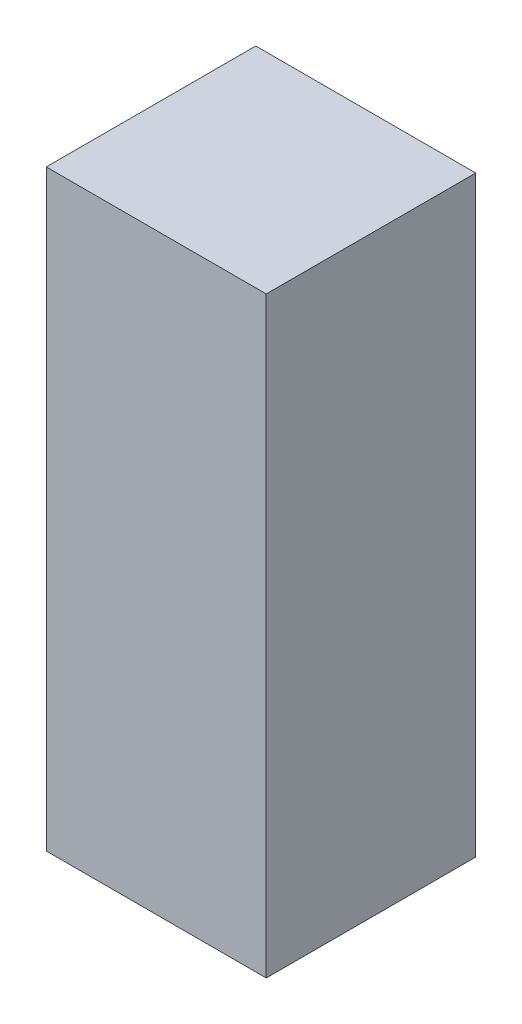
ISO-10303-21;
HEADER;
FILE_DESCRIPTION(('STEP AP214'),'2;1');
FILE_NAME('part.step','',(''),(''),'','','');
FILE_SCHEMA(('AUTOMOTIVE_DESIGN { 1 0 10303 214 1 1 1 1 }'));
ENDSEC;
DATA;
#1=APPLICATION_CONTEXT('core data for automotive mechanical design processes');
#2=APPLICATION_PROTOCOL_DEFINITION('international standard','automotive_design',2000,#1);
#3=PRODUCT_CONTEXT('',#1,'mechanical');
#4=PRODUCT('Part','Part','',(#3));
#5=PRODUCT_RELATED_PRODUCT_CATEGORY('part','',(#4));
#6=PRODUCT_DEFINITION_FORMATION('','',#4);
#7=PRODUCT_DEFINITION_CONTEXT('part definition',#1,'design');
#8=PRODUCT_DEFINITION('design','',#6,#7);
#9=PRODUCT_DEFINITION_SHAPE('','',#8);
#10=(LENGTH_UNIT() NAMED_UNIT(*) SI_UNIT(.MILLI.,.METRE.));
#11=(NAMED_UNIT(*) PLANE_ANGLE_UNIT() SI_UNIT($,.RADIAN.));
#12=(NAMED_UNIT(*) SI_UNIT($,.STERADIAN.) SOLID_ANGLE_UNIT());
#13=UNCERTAINTY_MEASURE_WITH_UNIT(LENGTH_MEASURE(1.E-05),#10,'distance_accuracy_value','');
#14=(GEOMETRIC_REPRESENTATION_CONTEXT(3) GLOBAL_UNCERTAINTY_ASSIGNED_CONTEXT((#13)) GLOBAL_UNIT_ASSIGNED_CONTEXT((#10,
#11,#12)) REPRESENTATION_CONTEXT('',''));
#15=CARTESIAN_POINT('',(0.,0.,0.));
#16=DIRECTION('',(0.,0.,1.));
#17=DIRECTION('',(1.,0.,0.));
#18=AXIS2_PLACEMENT_3D('',#15,#16,#17);
#19=CARTESIAN_POINT('',(10.761,-0.15,-6.999));
#20=DIRECTION('',(0.,-1.,0.));
#21=DIRECTION('',(-1.,0.,0.));
#22=AXIS2_PLACEMENT_3D('',#19,#20,#21);
#23=PLANE('',#22);
#24=DIRECTION('',(1.,0.,0.));
#25=VECTOR('',#24,1.);
#26=CARTESIAN_POINT('',(10.55,-0.15,-7.));
#27=LINE('',#26,#25);
#28=CARTESIAN_POINT('',(10.34,-0.15,-7.));
#29=VERTEX_POINT('',#28);
#30=CARTESIAN_POINT('',(10.76,-0.15,-7.));
#31=VERTEX_POINT('',#30);
#32=EDGE_CURVE('E69',#29,#31,#27,.T.);
#33=ORIENTED_EDGE('',*,*,#32,.F.);
#34=DIRECTION('',(0.,0.,1.));
#35=VECTOR('',#34,1.);
#36=CARTESIAN_POINT('',(10.34,-0.15,-7.2));
#37=LINE('',#36,#35);
#38=CARTESIAN_POINT('',(10.34,-0.15,-7.4));
#39=VERTEX_POINT('',#38);
#40=EDGE_CURVE('E56',#39,#29,#37,.T.);
#41=ORIENTED_EDGE('',*,*,#40,.F.);
#42=DIRECTION('',(-1.,0.,0.));
#43=VECTOR('',#42,1.);
#44=CARTESIAN_POINT('',(10.55,-0.15,-7.4));
#45=LINE('',#44,#43);
#46=CARTESIAN_POINT('',(10.76,-0.15,-7.4));
#47=VERTEX_POINT('',#46);
#48=EDGE_CURVE('E21',#47,#39,#45,.T.);
#49=ORIENTED_EDGE('',*,*,#48,.F.);
#50=DIRECTION('',(0.,0.,-1.));
#51=VECTOR('',#50,1.);
#52=CARTESIAN_POINT('',(10.76,-0.15,-7.2));
#53=LINE('',#52,#51);
#54=EDGE_CURVE('E82',#31,#47,#53,.T.);
#55=ORIENTED_EDGE('',*,*,#54,.F.);
#56=EDGE_LOOP('',(#33,#41,#49,#55));
#57=FACE_BOUND('',#56,.T.);
#58=ADVANCED_FACE('F17',(#57),#23,.T.);
#59=CARTESIAN_POINT('',(10.761,-0.151,-7.4));
#60=DIRECTION('',(0.,0.,-1.));
#61=DIRECTION('',(-1.,0.,0.));
#62=AXIS2_PLACEMENT_3D('',#59,#60,#61);
#63=PLANE('',#62);
#64=DIRECTION('',(0.,-1.,0.));
#65=VECTOR('',#64,1.);
#66=CARTESIAN_POINT('',(10.34,0.415616497642,-7.4));
#67=LINE('',#66,#65);
#68=CARTESIAN_POINT('',(10.34,0.981232995284,-7.4));
#69=VERTEX_POINT('',#68);
#70=EDGE_CURVE('E62',#69,#39,#67,.T.);
#71=ORIENTED_EDGE('',*,*,#70,.F.);
#72=DIRECTION('',(-1.,0.,0.));
#73=VECTOR('',#72,1.);
#74=CARTESIAN_POINT('',(10.55,0.981232995284,-7.4));
#75=LINE('',#74,#73);
#76=CARTESIAN_POINT('',(10.76,0.981232995284,-7.4));
#77=VERTEX_POINT('',#76);
#78=EDGE_CURVE('E84',#77,#69,#75,.T.);
#79=ORIENTED_EDGE('',*,*,#78,.F.);
#80=DIRECTION('',(0.,1.,0.));
#81=VECTOR('',#80,1.);
#82=CARTESIAN_POINT('',(10.76,0.415616497642,-7.4));
#83=LINE('',#82,#81);
#84=EDGE_CURVE('E65',#47,#77,#83,.T.);
#85=ORIENTED_EDGE('',*,*,#84,.F.);
#86=ORIENTED_EDGE('',*,*,#48,.T.);
#87=EDGE_LOOP('',(#71,#79,#85,#86));
#88=FACE_BOUND('',#87,.T.);
#89=ADVANCED_FACE('F61',(#88),#63,.T.);
#90=CARTESIAN_POINT('',(10.34,-0.151,-6.999));
#91=DIRECTION('',(-1.,0.,0.));
#92=DIRECTION('',(0.,1.,0.));
#93=AXIS2_PLACEMENT_3D('',#90,#91,#92);
#94=PLANE('',#93);
#95=DIRECTION('',(0.,-1.,0.));
#96=VECTOR('',#95,1.);
#97=CARTESIAN_POINT('',(10.34,0.415616497642,-7.));
#98=LINE('',#97,#96);
#99=CARTESIAN_POINT('',(10.34,0.981232995284,-7.));
#100=VERTEX_POINT('',#99);
#101=EDGE_CURVE('E71',#100,#29,#98,.T.);
#102=ORIENTED_EDGE('',*,*,#101,.F.);
#103=DIRECTION('',(0.,0.,1.));
#104=VECTOR('',#103,1.);
#105=CARTESIAN_POINT('',(10.34,0.981232995284,-7.2));
#106=LINE('',#105,#104);
#107=EDGE_CURVE('E75',#69,#100,#106,.T.);
#108=ORIENTED_EDGE('',*,*,#107,.F.);
#109=ORIENTED_EDGE('',*,*,#70,.T.);
#110=ORIENTED_EDGE('',*,*,#40,.T.);
#111=EDGE_LOOP('',(#102,#108,#109,#110));
#112=FACE_BOUND('',#111,.T.);
#113=ADVANCED_FACE('F73',(#112),#94,.T.);
#114=CARTESIAN_POINT('',(10.339,-0.151,-7.));
#115=DIRECTION('',(0.,0.,1.));
#116=DIRECTION('',(1.,0.,0.));
#117=AXIS2_PLACEMENT_3D('',#114,#115,#116);
#118=PLANE('',#117);
#119=ORIENTED_EDGE('',*,*,#32,.T.);
#120=DIRECTION('',(0.,-1.,0.));
#121=VECTOR('',#120,1.);
#122=CARTESIAN_POINT('',(10.76,0.415616497642,-7.));
#123=LINE('',#122,#121);
#124=CARTESIAN_POINT('',(10.76,0.981232995284,-7.));
#125=VERTEX_POINT('',#124);
#126=EDGE_CURVE('E36',#125,#31,#123,.T.);
#127=ORIENTED_EDGE('',*,*,#126,.F.);
#128=DIRECTION('',(1.,0.,0.));
#129=VECTOR('',#128,1.);
#130=CARTESIAN_POINT('',(10.55,0.981232995284,-7.));
#131=LINE('',#130,#129);
#132=EDGE_CURVE('E27',#100,#125,#131,.T.);
#133=ORIENTED_EDGE('',*,*,#132,.F.);
#134=ORIENTED_EDGE('',*,*,#101,.T.);
#135=EDGE_LOOP('',(#119,#127,#133,#134));
#136=FACE_BOUND('',#135,.T.);
#137=ADVANCED_FACE('F89',(#136),#118,.T.);
#138=CARTESIAN_POINT('',(10.76,0.982232995284,-6.999));
#139=DIRECTION('',(1.,0.,0.));
#140=DIRECTION('',(0.,-1.,0.));
#141=AXIS2_PLACEMENT_3D('',#138,#139,#140);
#142=PLANE('',#141);
#143=ORIENTED_EDGE('',*,*,#126,.T.);
#144=ORIENTED_EDGE('',*,*,#54,.T.);
#145=ORIENTED_EDGE('',*,*,#84,.T.);
#146=DIRECTION('',(0.,0.,-1.));
#147=VECTOR('',#146,1.);
#148=CARTESIAN_POINT('',(10.76,0.981232995284,-7.2));
#149=LINE('',#148,#147);
#150=EDGE_CURVE('E11',#125,#77,#149,.T.);
#151=ORIENTED_EDGE('',*,*,#150,.F.);
#152=EDGE_LOOP('',(#143,#144,#145,#151));
#153=FACE_BOUND('',#152,.T.);
#154=ADVANCED_FACE('F91',(#153),#142,.T.);
#155=CARTESIAN_POINT('',(10.339,0.981232995284,-6.999));
#156=DIRECTION('',(0.,1.,0.));
#157=DIRECTION('',(1.,0.,0.));
#158=AXIS2_PLACEMENT_3D('',#155,#156,#157);
#159=PLANE('',#158);
#160=ORIENTED_EDGE('',*,*,#132,.T.);
#161=ORIENTED_EDGE('',*,*,#150,.T.);
#162=ORIENTED_EDGE('',*,*,#78,.T.);
#163=ORIENTED_EDGE('',*,*,#107,.T.);
#164=EDGE_LOOP('',(#160,#161,#162,#163));
#165=FACE_BOUND('',#164,.T.);
#166=ADVANCED_FACE('F19',(#165),#159,.T.);
#167=CLOSED_SHELL('',(#58,#89,#113,#137,#154,#166));
#168=MANIFOLD_SOLID_BREP('B1',#167);
#169=ADVANCED_BREP_SHAPE_REPRESENTATION('',(#18,#168),#14);
#170=SHAPE_DEFINITION_REPRESENTATION(#9,#169);
ENDSEC;
END-ISO-10303-21;
